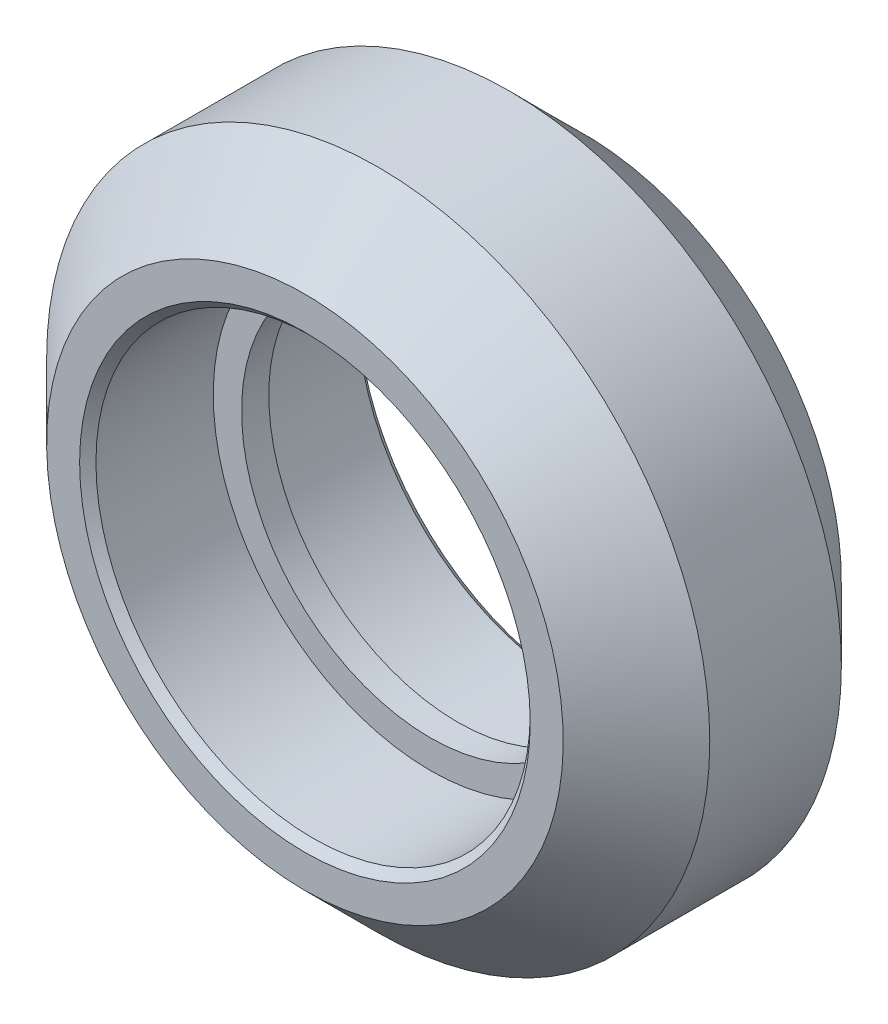
ISO-10303-21;
HEADER;
FILE_DESCRIPTION(('STEP AP214'),'2;1');
FILE_NAME('part.step','',(''),(''),'','','');
FILE_SCHEMA(('AUTOMOTIVE_DESIGN { 1 0 10303 214 1 1 1 1 }'));
ENDSEC;
DATA;
#1=APPLICATION_CONTEXT('core data for automotive mechanical design processes');
#2=APPLICATION_PROTOCOL_DEFINITION('international standard','automotive_design',2000,#1);
#3=PRODUCT_CONTEXT('',#1,'mechanical');
#4=PRODUCT('Part','Part','',(#3));
#5=PRODUCT_RELATED_PRODUCT_CATEGORY('part','',(#4));
#6=PRODUCT_DEFINITION_FORMATION('','',#4);
#7=PRODUCT_DEFINITION_CONTEXT('part definition',#1,'design');
#8=PRODUCT_DEFINITION('design','',#6,#7);
#9=PRODUCT_DEFINITION_SHAPE('','',#8);
#10=(LENGTH_UNIT() NAMED_UNIT(*) SI_UNIT(.MILLI.,.METRE.));
#11=(NAMED_UNIT(*) PLANE_ANGLE_UNIT() SI_UNIT($,.RADIAN.));
#12=(NAMED_UNIT(*) SI_UNIT($,.STERADIAN.) SOLID_ANGLE_UNIT());
#13=UNCERTAINTY_MEASURE_WITH_UNIT(LENGTH_MEASURE(1.E-05),#10,'distance_accuracy_value','');
#14=(GEOMETRIC_REPRESENTATION_CONTEXT(3) GLOBAL_UNCERTAINTY_ASSIGNED_CONTEXT((#13)) GLOBAL_UNIT_ASSIGNED_CONTEXT((#10,
#11,#12)) REPRESENTATION_CONTEXT('',''));
#15=CARTESIAN_POINT('',(0.,0.,0.));
#16=DIRECTION('',(0.,0.,1.));
#17=DIRECTION('',(1.,0.,0.));
#18=AXIS2_PLACEMENT_3D('',#15,#16,#17);
#19=CARTESIAN_POINT('',(0.,0.,5.115));
#20=DIRECTION('',(0.,0.,1.));
#21=DIRECTION('',(0.,-1.,0.));
#22=AXIS2_PLACEMENT_3D('',#19,#20,#21);
#23=CYLINDRICAL_SURFACE('',#22,7.987);
#24=CARTESIAN_POINT('',(0.,0.,4.815));
#25=DIRECTION('',(0.,0.,-1.));
#26=DIRECTION('',(0.,1.,0.));
#27=AXIS2_PLACEMENT_3D('',#24,#25,#26);
#28=CIRCLE('',#27,7.987);
#29=CARTESIAN_POINT('',(0.,7.987,4.815));
#30=VERTEX_POINT('',#29);
#31=EDGE_CURVE('E46',#30,#30,#28,.F.);
#32=ORIENTED_EDGE('',*,*,#31,.T.);
#33=EDGE_LOOP('',(#32));
#34=FACE_BOUND('',#33,.T.);
#35=CARTESIAN_POINT('',(0.,0.,0.499999999999998));
#36=DIRECTION('',(0.,0.,1.));
#37=DIRECTION('',(0.,-1.,0.));
#38=AXIS2_PLACEMENT_3D('',#35,#36,#37);
#39=CIRCLE('',#38,7.987);
#40=CARTESIAN_POINT('',(0.,-7.987,0.499999999999996));
#41=VERTEX_POINT('',#40);
#42=EDGE_CURVE('E72',#41,#41,#39,.T.);
#43=ORIENTED_EDGE('',*,*,#42,.F.);
#44=EDGE_LOOP('',(#43));
#45=FACE_BOUND('',#44,.T.);
#46=ADVANCED_FACE('F31',(#34,#45),#23,.F.);
#47=CARTESIAN_POINT('',(0.,9.5,5.115));
#48=DIRECTION('',(0.,0.,-1.));
#49=DIRECTION('',(0.,1.,0.));
#50=AXIS2_PLACEMENT_3D('',#47,#48,#49);
#51=PLANE('',#50);
#52=CARTESIAN_POINT('',(0.,0.,5.115));
#53=DIRECTION('',(0.,0.,-1.));
#54=DIRECTION('',(0.,1.,0.));
#55=AXIS2_PLACEMENT_3D('',#52,#53,#54);
#56=CIRCLE('',#55,8.287);
#57=CARTESIAN_POINT('',(0.,8.287,5.115));
#58=VERTEX_POINT('',#57);
#59=EDGE_CURVE('E42',#58,#58,#56,.T.);
#60=ORIENTED_EDGE('',*,*,#59,.T.);
#61=EDGE_LOOP('',(#60));
#62=FACE_BOUND('',#61,.T.);
#63=CARTESIAN_POINT('',(0.,0.,5.115));
#64=DIRECTION('',(0.,0.,1.));
#65=DIRECTION('',(0.,-1.,0.));
#66=AXIS2_PLACEMENT_3D('',#63,#64,#65);
#67=CIRCLE('',#66,9.5);
#68=CARTESIAN_POINT('',(0.,-9.5,5.11499999999999));
#69=VERTEX_POINT('',#68);
#70=EDGE_CURVE('E51',#69,#69,#67,.T.);
#71=ORIENTED_EDGE('',*,*,#70,.T.);
#72=EDGE_LOOP('',(#71));
#73=FACE_BOUND('',#72,.T.);
#74=ADVANCED_FACE('F79',(#62,#73),#51,.F.);
#75=CARTESIAN_POINT('',(0.,0.,2.42));
#76=DIRECTION('',(0.,0.,-1.));
#77=DIRECTION('',(0.,1.,0.));
#78=AXIS2_PLACEMENT_3D('',#75,#76,#77);
#79=CONICAL_SURFACE('',#78,12.195,0.78539816339745);
#80=ORIENTED_EDGE('',*,*,#70,.F.);
#81=EDGE_LOOP('',(#80));
#82=FACE_BOUND('',#81,.T.);
#83=CARTESIAN_POINT('',(0.,0.,2.42));
#84=DIRECTION('',(0.,0.,1.));
#85=DIRECTION('',(0.,-1.,0.));
#86=AXIS2_PLACEMENT_3D('',#83,#84,#85);
#87=CIRCLE('',#86,12.195);
#88=CARTESIAN_POINT('',(0.,-12.195,2.42));
#89=VERTEX_POINT('',#88);
#90=EDGE_CURVE('E54',#89,#89,#87,.T.);
#91=ORIENTED_EDGE('',*,*,#90,.T.);
#92=EDGE_LOOP('',(#91));
#93=FACE_BOUND('',#92,.T.);
#94=ADVANCED_FACE('F85',(#82,#93),#79,.T.);
#95=CARTESIAN_POINT('',(0.,0.,5.115));
#96=DIRECTION('',(0.,0.,1.));
#97=DIRECTION('',(0.,-1.,0.));
#98=AXIS2_PLACEMENT_3D('',#95,#96,#97);
#99=CYLINDRICAL_SURFACE('',#98,12.195);
#100=ORIENTED_EDGE('',*,*,#90,.F.);
#101=EDGE_LOOP('',(#100));
#102=FACE_BOUND('',#101,.T.);
#103=CARTESIAN_POINT('',(0.,0.,-2.42000000000001));
#104=DIRECTION('',(0.,0.,1.));
#105=DIRECTION('',(0.,-1.,0.));
#106=AXIS2_PLACEMENT_3D('',#103,#104,#105);
#107=CIRCLE('',#106,12.195);
#108=CARTESIAN_POINT('',(0.,-12.195,-2.42000000000001));
#109=VERTEX_POINT('',#108);
#110=EDGE_CURVE('E57',#109,#109,#107,.T.);
#111=ORIENTED_EDGE('',*,*,#110,.T.);
#112=EDGE_LOOP('',(#111));
#113=FACE_BOUND('',#112,.T.);
#114=ADVANCED_FACE('F108',(#102,#113),#99,.T.);
#115=CARTESIAN_POINT('',(0.,0.,-5.115));
#116=DIRECTION('',(0.,0.,1.));
#117=DIRECTION('',(0.,-1.,0.));
#118=AXIS2_PLACEMENT_3D('',#115,#116,#117);
#119=CONICAL_SURFACE('',#118,9.5,0.78539816339745);
#120=ORIENTED_EDGE('',*,*,#110,.F.);
#121=EDGE_LOOP('',(#120));
#122=FACE_BOUND('',#121,.T.);
#123=CARTESIAN_POINT('',(0.,0.,-5.115));
#124=DIRECTION('',(0.,0.,1.));
#125=DIRECTION('',(0.,-1.,0.));
#126=AXIS2_PLACEMENT_3D('',#123,#124,#125);
#127=CIRCLE('',#126,9.5);
#128=CARTESIAN_POINT('',(0.,-9.5,-5.115));
#129=VERTEX_POINT('',#128);
#130=EDGE_CURVE('E60',#129,#129,#127,.T.);
#131=ORIENTED_EDGE('',*,*,#130,.T.);
#132=EDGE_LOOP('',(#131));
#133=FACE_BOUND('',#132,.T.);
#134=ADVANCED_FACE('F113',(#122,#133),#119,.T.);
#135=CARTESIAN_POINT('',(0.,9.5,-5.115));
#136=DIRECTION('',(0.,0.,1.));
#137=DIRECTION('',(0.,-1.,0.));
#138=AXIS2_PLACEMENT_3D('',#135,#136,#137);
#139=PLANE('',#138);
#140=CARTESIAN_POINT('',(0.,0.,-5.115));
#141=DIRECTION('',(0.,0.,1.));
#142=DIRECTION('',(0.,-1.,0.));
#143=AXIS2_PLACEMENT_3D('',#140,#141,#142);
#144=CIRCLE('',#143,8.287);
#145=CARTESIAN_POINT('',(0.,-8.28699999999999,-5.115));
#146=VERTEX_POINT('',#145);
#147=EDGE_CURVE('E38',#146,#146,#144,.T.);
#148=ORIENTED_EDGE('',*,*,#147,.T.);
#149=EDGE_LOOP('',(#148));
#150=FACE_BOUND('',#149,.T.);
#151=ORIENTED_EDGE('',*,*,#130,.F.);
#152=EDGE_LOOP('',(#151));
#153=FACE_BOUND('',#152,.T.);
#154=ADVANCED_FACE('F119',(#150,#153),#139,.F.);
#155=CARTESIAN_POINT('',(0.,0.,5.115));
#156=DIRECTION('',(0.,0.,1.));
#157=DIRECTION('',(0.,-1.,0.));
#158=AXIS2_PLACEMENT_3D('',#155,#156,#157);
#159=CYLINDRICAL_SURFACE('',#158,7.987);
#160=CARTESIAN_POINT('',(0.,0.,-4.81500000000001));
#161=DIRECTION('',(0.,0.,1.));
#162=DIRECTION('',(0.,-1.,0.));
#163=AXIS2_PLACEMENT_3D('',#160,#161,#162);
#164=CIRCLE('',#163,7.987);
#165=CARTESIAN_POINT('',(0.,-7.987,-4.81500000000001));
#166=VERTEX_POINT('',#165);
#167=EDGE_CURVE('E10',#166,#166,#164,.F.);
#168=ORIENTED_EDGE('',*,*,#167,.T.);
#169=EDGE_LOOP('',(#168));
#170=FACE_BOUND('',#169,.T.);
#171=CARTESIAN_POINT('',(0.,0.,-0.500000000000001));
#172=DIRECTION('',(0.,0.,1.));
#173=DIRECTION('',(0.,-1.,0.));
#174=AXIS2_PLACEMENT_3D('',#171,#172,#173);
#175=CIRCLE('',#174,7.987);
#176=CARTESIAN_POINT('',(0.,-7.987,-0.500000000000003));
#177=VERTEX_POINT('',#176);
#178=EDGE_CURVE('E63',#177,#177,#175,.T.);
#179=ORIENTED_EDGE('',*,*,#178,.T.);
#180=EDGE_LOOP('',(#179));
#181=FACE_BOUND('',#180,.T.);
#182=ADVANCED_FACE('F124',(#170,#181),#159,.F.);
#183=CARTESIAN_POINT('',(0.,7.987,-0.5));
#184=DIRECTION('',(0.,0.,1.));
#185=DIRECTION('',(0.,-1.,0.));
#186=AXIS2_PLACEMENT_3D('',#183,#184,#185);
#187=PLANE('',#186);
#188=ORIENTED_EDGE('',*,*,#178,.F.);
#189=EDGE_LOOP('',(#188));
#190=FACE_BOUND('',#189,.T.);
#191=CARTESIAN_POINT('',(0.,0.,-0.500000000000002));
#192=DIRECTION('',(0.,0.,1.));
#193=DIRECTION('',(0.,-1.,0.));
#194=AXIS2_PLACEMENT_3D('',#191,#192,#193);
#195=CIRCLE('',#194,6.945);
#196=CARTESIAN_POINT('',(0.,-6.945,-0.500000000000003));
#197=VERTEX_POINT('',#196);
#198=EDGE_CURVE('E66',#197,#197,#195,.T.);
#199=ORIENTED_EDGE('',*,*,#198,.T.);
#200=EDGE_LOOP('',(#199));
#201=FACE_BOUND('',#200,.T.);
#202=ADVANCED_FACE('F129',(#190,#201),#187,.F.);
#203=CARTESIAN_POINT('',(0.,0.,5.115));
#204=DIRECTION('',(0.,0.,1.));
#205=DIRECTION('',(0.,-1.,0.));
#206=AXIS2_PLACEMENT_3D('',#203,#204,#205);
#207=CYLINDRICAL_SURFACE('',#206,6.945);
#208=ORIENTED_EDGE('',*,*,#198,.F.);
#209=EDGE_LOOP('',(#208));
#210=FACE_BOUND('',#209,.T.);
#211=CARTESIAN_POINT('',(0.,0.,0.499999999999999));
#212=DIRECTION('',(0.,0.,1.));
#213=DIRECTION('',(0.,-1.,0.));
#214=AXIS2_PLACEMENT_3D('',#211,#212,#213);
#215=CIRCLE('',#214,6.945);
#216=CARTESIAN_POINT('',(0.,-6.945,0.499999999999997));
#217=VERTEX_POINT('',#216);
#218=EDGE_CURVE('E69',#217,#217,#215,.T.);
#219=ORIENTED_EDGE('',*,*,#218,.T.);
#220=EDGE_LOOP('',(#219));
#221=FACE_BOUND('',#220,.T.);
#222=ADVANCED_FACE('F97',(#210,#221),#207,.F.);
#223=CARTESIAN_POINT('',(0.,7.987,0.5));
#224=DIRECTION('',(0.,0.,-1.));
#225=DIRECTION('',(0.,1.,0.));
#226=AXIS2_PLACEMENT_3D('',#223,#224,#225);
#227=PLANE('',#226);
#228=ORIENTED_EDGE('',*,*,#218,.F.);
#229=EDGE_LOOP('',(#228));
#230=FACE_BOUND('',#229,.T.);
#231=ORIENTED_EDGE('',*,*,#42,.T.);
#232=EDGE_LOOP('',(#231));
#233=FACE_BOUND('',#232,.T.);
#234=ADVANCED_FACE('F76',(#230,#233),#227,.F.);
#235=CARTESIAN_POINT('',(0.,0.,4.815));
#236=DIRECTION('',(0.,0.,1.));
#237=DIRECTION('',(0.,-1.,0.));
#238=AXIS2_PLACEMENT_3D('',#235,#236,#237);
#239=CONICAL_SURFACE('',#238,7.987,0.785398163397443);
#240=ORIENTED_EDGE('',*,*,#59,.F.);
#241=EDGE_LOOP('',(#240));
#242=FACE_BOUND('',#241,.T.);
#243=ORIENTED_EDGE('',*,*,#31,.F.);
#244=EDGE_LOOP('',(#243));
#245=FACE_BOUND('',#244,.T.);
#246=ADVANCED_FACE('F89',(#242,#245),#239,.F.);
#247=CARTESIAN_POINT('',(0.,0.,-5.115));
#248=DIRECTION('',(0.,0.,-1.));
#249=DIRECTION('',(0.,1.,0.));
#250=AXIS2_PLACEMENT_3D('',#247,#248,#249);
#251=CONICAL_SURFACE('',#250,8.287,0.785398163397454);
#252=ORIENTED_EDGE('',*,*,#167,.F.);
#253=EDGE_LOOP('',(#252));
#254=FACE_BOUND('',#253,.T.);
#255=ORIENTED_EDGE('',*,*,#147,.F.);
#256=EDGE_LOOP('',(#255));
#257=FACE_BOUND('',#256,.T.);
#258=ADVANCED_FACE('F33',(#254,#257),#251,.F.);
#259=CLOSED_SHELL('',(#46,#74,#94,#114,#134,#154,#182,#202,#222,#234,#246,#258));
#260=MANIFOLD_SOLID_BREP('B2',#259);
#261=ADVANCED_BREP_SHAPE_REPRESENTATION('',(#18,#260),#14);
#262=SHAPE_DEFINITION_REPRESENTATION(#9,#261);
ENDSEC;
END-ISO-10303-21;
